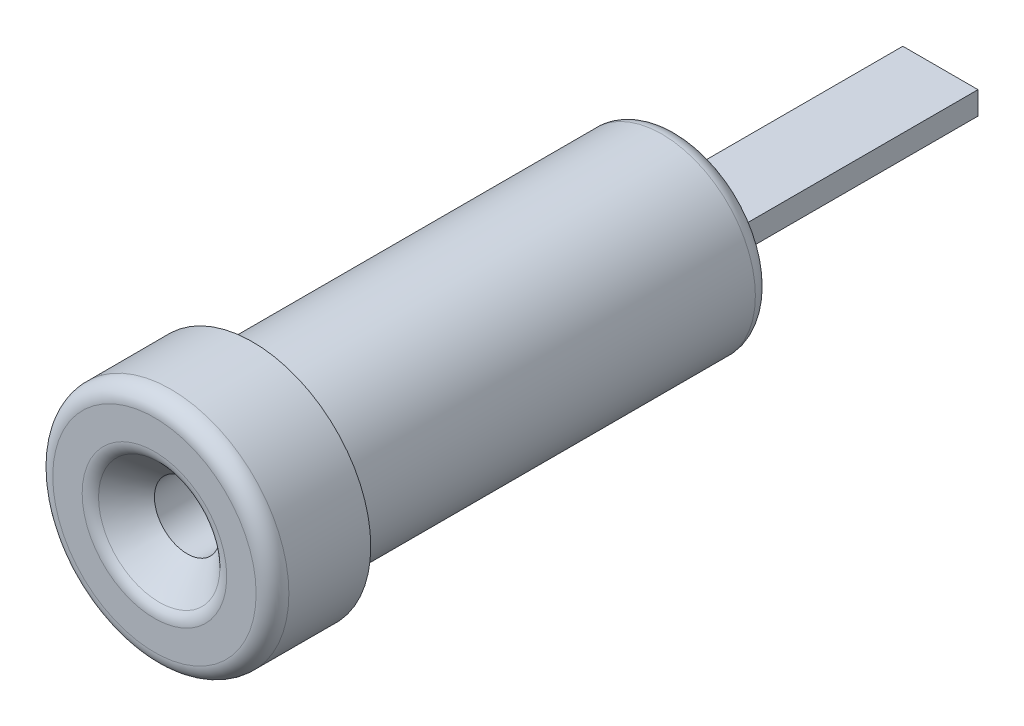
ISO-10303-21;
HEADER;
FILE_DESCRIPTION(('STEP AP214'),'2;1');
FILE_NAME('part.step','',(''),(''),'','','');
FILE_SCHEMA(('AUTOMOTIVE_DESIGN { 1 0 10303 214 1 1 1 1 }'));
ENDSEC;
DATA;
#1=APPLICATION_CONTEXT('core data for automotive mechanical design processes');
#2=APPLICATION_PROTOCOL_DEFINITION('international standard','automotive_design',2000,#1);
#3=PRODUCT_CONTEXT('',#1,'mechanical');
#4=PRODUCT('Part','Part','',(#3));
#5=PRODUCT_RELATED_PRODUCT_CATEGORY('part','',(#4));
#6=PRODUCT_DEFINITION_FORMATION('','',#4);
#7=PRODUCT_DEFINITION_CONTEXT('part definition',#1,'design');
#8=PRODUCT_DEFINITION('design','',#6,#7);
#9=PRODUCT_DEFINITION_SHAPE('','',#8);
#10=(LENGTH_UNIT() NAMED_UNIT(*) SI_UNIT(.MILLI.,.METRE.));
#11=(NAMED_UNIT(*) PLANE_ANGLE_UNIT() SI_UNIT($,.RADIAN.));
#12=(NAMED_UNIT(*) SI_UNIT($,.STERADIAN.) SOLID_ANGLE_UNIT());
#13=UNCERTAINTY_MEASURE_WITH_UNIT(LENGTH_MEASURE(1.E-05),#10,'distance_accuracy_value','');
#14=(GEOMETRIC_REPRESENTATION_CONTEXT(3) GLOBAL_UNCERTAINTY_ASSIGNED_CONTEXT((#13)) GLOBAL_UNIT_ASSIGNED_CONTEXT((#10,
#11,#12)) REPRESENTATION_CONTEXT('',''));
#15=CARTESIAN_POINT('',(0.,0.,0.));
#16=DIRECTION('',(0.,0.,1.));
#17=DIRECTION('',(1.,0.,0.));
#18=AXIS2_PLACEMENT_3D('',#15,#16,#17);
#19=CARTESIAN_POINT('',(0.,3.605,0.));
#20=DIRECTION('',(0.,0.,-1.));
#21=DIRECTION('',(-1.,0.,0.));
#22=AXIS2_PLACEMENT_3D('',#19,#20,#21);
#23=PLANE('',#22);
#24=CARTESIAN_POINT('',(0.,0.,0.));
#25=DIRECTION('',(0.,0.,-1.));
#26=DIRECTION('',(-1.,0.,0.));
#27=AXIS2_PLACEMENT_3D('',#24,#25,#26);
#28=CIRCLE('',#27,3.105);
#29=CARTESIAN_POINT('',(-3.105,0.,0.));
#30=VERTEX_POINT('',#29);
#31=EDGE_CURVE('E123',#30,#30,#28,.F.);
#32=ORIENTED_EDGE('',*,*,#31,.T.);
#33=EDGE_LOOP('',(#32));
#34=FACE_BOUND('',#33,.T.);
#35=CARTESIAN_POINT('',(0.,0.,0.));
#36=DIRECTION('',(0.,0.,-1.));
#37=DIRECTION('',(-1.,0.,0.));
#38=AXIS2_PLACEMENT_3D('',#35,#36,#37);
#39=CIRCLE('',#38,2.20710678118655);
#40=CARTESIAN_POINT('',(-2.20710678118655,0.,0.));
#41=VERTEX_POINT('',#40);
#42=EDGE_CURVE('E120',#41,#41,#39,.T.);
#43=ORIENTED_EDGE('',*,*,#42,.T.);
#44=EDGE_LOOP('',(#43));
#45=FACE_BOUND('',#44,.T.);
#46=ADVANCED_FACE('F35',(#34,#45),#23,.F.);
#47=CARTESIAN_POINT('',(0.,0.,0.));
#48=DIRECTION('',(0.,0.,1.));
#49=DIRECTION('',(1.,0.,0.));
#50=AXIS2_PLACEMENT_3D('',#47,#48,#49);
#51=CYLINDRICAL_SURFACE('',#50,1.);
#52=CARTESIAN_POINT('',(0.,0.,-1.));
#53=DIRECTION('',(0.,0.,-1.));
#54=DIRECTION('',(-1.,0.,0.));
#55=AXIS2_PLACEMENT_3D('',#52,#53,#54);
#56=CIRCLE('',#55,1.);
#57=CARTESIAN_POINT('',(-1.,0.,-1.));
#58=VERTEX_POINT('',#57);
#59=EDGE_CURVE('E117',#58,#58,#56,.F.);
#60=ORIENTED_EDGE('',*,*,#59,.T.);
#61=EDGE_LOOP('',(#60));
#62=FACE_BOUND('',#61,.T.);
#63=CARTESIAN_POINT('',(0.,0.,-12.));
#64=DIRECTION('',(0.,0.,1.));
#65=DIRECTION('',(1.,0.,0.));
#66=AXIS2_PLACEMENT_3D('',#63,#64,#65);
#67=CIRCLE('',#66,1.);
#68=CARTESIAN_POINT('',(1.,0.,-12.));
#69=VERTEX_POINT('',#68);
#70=EDGE_CURVE('E114',#69,#69,#67,.T.);
#71=ORIENTED_EDGE('',*,*,#70,.F.);
#72=EDGE_LOOP('',(#71));
#73=FACE_BOUND('',#72,.T.);
#74=ADVANCED_FACE('F147',(#62,#73),#51,.F.);
#75=CARTESIAN_POINT('',(0.,1.,-12.));
#76=DIRECTION('',(0.,0.,-1.));
#77=DIRECTION('',(-1.,0.,0.));
#78=AXIS2_PLACEMENT_3D('',#75,#76,#77);
#79=PLANE('',#78);
#80=ORIENTED_EDGE('',*,*,#70,.T.);
#81=EDGE_LOOP('',(#80));
#82=FACE_BOUND('',#81,.T.);
#83=ADVANCED_FACE('F153',(#82),#79,.F.);
#84=CARTESIAN_POINT('',(0.,1.2,-16.));
#85=DIRECTION('',(0.,0.,1.));
#86=DIRECTION('',(1.,0.,0.));
#87=AXIS2_PLACEMENT_3D('',#84,#85,#86);
#88=PLANE('',#87);
#89=CARTESIAN_POINT('',(0.,0.,-16.));
#90=DIRECTION('',(0.,0.,1.));
#91=DIRECTION('',(1.,0.,0.));
#92=AXIS2_PLACEMENT_3D('',#89,#90,#91);
#93=CIRCLE('',#92,2.35);
#94=CARTESIAN_POINT('',(2.35,0.,-16.));
#95=VERTEX_POINT('',#94);
#96=EDGE_CURVE('E11',#95,#95,#93,.F.);
#97=ORIENTED_EDGE('',*,*,#96,.T.);
#98=EDGE_LOOP('',(#97));
#99=FACE_BOUND('',#98,.T.);
#100=DIRECTION('',(0.,-1.,0.));
#101=VECTOR('',#100,1.);
#102=CARTESIAN_POINT('',(1.1478240283249,0.35,-16.));
#103=LINE('',#102,#101);
#104=CARTESIAN_POINT('',(1.1478240283249,0.35,-16.));
#105=VERTEX_POINT('',#104);
#106=CARTESIAN_POINT('',(1.1478240283249,-0.35,-16.));
#107=VERTEX_POINT('',#106);
#108=EDGE_CURVE('E89',#105,#107,#103,.T.);
#109=ORIENTED_EDGE('',*,*,#108,.F.);
#110=DIRECTION('',(1.,0.,0.));
#111=VECTOR('',#110,1.);
#112=CARTESIAN_POINT('',(1.1478240283249,0.35,-16.));
#113=LINE('',#112,#111);
#114=CARTESIAN_POINT('',(-1.1478240283249,0.35,-16.));
#115=VERTEX_POINT('',#114);
#116=EDGE_CURVE('E57',#115,#105,#113,.T.);
#117=ORIENTED_EDGE('',*,*,#116,.F.);
#118=DIRECTION('',(0.,1.,0.));
#119=VECTOR('',#118,1.);
#120=CARTESIAN_POINT('',(-1.1478240283249,0.35,-16.));
#121=LINE('',#120,#119);
#122=CARTESIAN_POINT('',(-1.1478240283249,-0.35,-16.));
#123=VERTEX_POINT('',#122);
#124=EDGE_CURVE('E86',#123,#115,#121,.T.);
#125=ORIENTED_EDGE('',*,*,#124,.F.);
#126=DIRECTION('',(-1.,0.,0.));
#127=VECTOR('',#126,1.);
#128=CARTESIAN_POINT('',(1.1478240283249,-0.35,-16.));
#129=LINE('',#128,#127);
#130=EDGE_CURVE('E94',#107,#123,#129,.T.);
#131=ORIENTED_EDGE('',*,*,#130,.F.);
#132=EDGE_LOOP('',(#109,#117,#125,#131));
#133=FACE_BOUND('',#132,.T.);
#134=ADVANCED_FACE('F85',(#99,#133),#88,.F.);
#135=CARTESIAN_POINT('',(0.,0.,0.));
#136=DIRECTION('',(0.,0.,1.));
#137=DIRECTION('',(1.,0.,0.));
#138=AXIS2_PLACEMENT_3D('',#135,#136,#137);
#139=CYLINDRICAL_SURFACE('',#138,2.85);
#140=CARTESIAN_POINT('',(0.,0.,-15.5));
#141=DIRECTION('',(0.,0.,1.));
#142=DIRECTION('',(1.,0.,0.));
#143=AXIS2_PLACEMENT_3D('',#140,#141,#142);
#144=CIRCLE('',#143,2.85);
#145=CARTESIAN_POINT('',(2.85,0.,-15.5));
#146=VERTEX_POINT('',#145);
#147=EDGE_CURVE('E43',#146,#146,#144,.T.);
#148=ORIENTED_EDGE('',*,*,#147,.T.);
#149=EDGE_LOOP('',(#148));
#150=FACE_BOUND('',#149,.T.);
#151=CARTESIAN_POINT('',(0.,0.,-3.));
#152=DIRECTION('',(0.,0.,1.));
#153=DIRECTION('',(1.,0.,0.));
#154=AXIS2_PLACEMENT_3D('',#151,#152,#153);
#155=CIRCLE('',#154,2.85);
#156=CARTESIAN_POINT('',(2.85,0.,-3.));
#157=VERTEX_POINT('',#156);
#158=EDGE_CURVE('E111',#157,#157,#155,.T.);
#159=ORIENTED_EDGE('',*,*,#158,.F.);
#160=EDGE_LOOP('',(#159));
#161=FACE_BOUND('',#160,.T.);
#162=ADVANCED_FACE('F134',(#150,#161),#139,.T.);
#163=CARTESIAN_POINT('',(0.,2.85,-3.));
#164=DIRECTION('',(0.,0.,1.));
#165=DIRECTION('',(1.,0.,0.));
#166=AXIS2_PLACEMENT_3D('',#163,#164,#165);
#167=PLANE('',#166);
#168=CARTESIAN_POINT('',(0.,0.,-3.));
#169=DIRECTION('',(0.,0.,1.));
#170=DIRECTION('',(1.,0.,0.));
#171=AXIS2_PLACEMENT_3D('',#168,#169,#170);
#172=CIRCLE('',#171,3.605);
#173=CARTESIAN_POINT('',(3.605,0.,-3.));
#174=VERTEX_POINT('',#173);
#175=EDGE_CURVE('E101',#174,#174,#172,.T.);
#176=ORIENTED_EDGE('',*,*,#175,.F.);
#177=EDGE_LOOP('',(#176));
#178=FACE_BOUND('',#177,.T.);
#179=ORIENTED_EDGE('',*,*,#158,.T.);
#180=EDGE_LOOP('',(#179));
#181=FACE_BOUND('',#180,.T.);
#182=ADVANCED_FACE('F175',(#178,#181),#167,.F.);
#183=CARTESIAN_POINT('',(0.,0.,0.));
#184=DIRECTION('',(0.,0.,1.));
#185=DIRECTION('',(1.,0.,0.));
#186=AXIS2_PLACEMENT_3D('',#183,#184,#185);
#187=CYLINDRICAL_SURFACE('',#186,3.605);
#188=CARTESIAN_POINT('',(0.,0.,-0.5));
#189=DIRECTION('',(0.,0.,-1.));
#190=DIRECTION('',(-1.,0.,0.));
#191=AXIS2_PLACEMENT_3D('',#188,#189,#190);
#192=CIRCLE('',#191,3.605);
#193=CARTESIAN_POINT('',(-3.605,0.,-0.5));
#194=VERTEX_POINT('',#193);
#195=EDGE_CURVE('E126',#194,#194,#192,.T.);
#196=ORIENTED_EDGE('',*,*,#195,.T.);
#197=EDGE_LOOP('',(#196));
#198=FACE_BOUND('',#197,.T.);
#199=ORIENTED_EDGE('',*,*,#175,.T.);
#200=EDGE_LOOP('',(#199));
#201=FACE_BOUND('',#200,.T.);
#202=ADVANCED_FACE('F172',(#198,#201),#187,.T.);
#203=CARTESIAN_POINT('',(-1.1478240283249,0.35,-10.3));
#204=DIRECTION('',(-1.,0.,0.));
#205=DIRECTION('',(0.,0.,1.));
#206=AXIS2_PLACEMENT_3D('',#203,#204,#205);
#207=PLANE('',#206);
#208=ORIENTED_EDGE('',*,*,#124,.T.);
#209=DIRECTION('',(0.,0.,-1.));
#210=VECTOR('',#209,1.);
#211=CARTESIAN_POINT('',(-1.1478240283249,0.35,-10.3));
#212=LINE('',#211,#210);
#213=CARTESIAN_POINT('',(-1.1478240283249,0.35,-24.));
#214=VERTEX_POINT('',#213);
#215=EDGE_CURVE('E75',#115,#214,#212,.T.);
#216=ORIENTED_EDGE('',*,*,#215,.T.);
#217=DIRECTION('',(0.,1.,0.));
#218=VECTOR('',#217,1.);
#219=CARTESIAN_POINT('',(-1.1478240283249,0.35,-24.));
#220=LINE('',#219,#218);
#221=CARTESIAN_POINT('',(-1.1478240283249,-0.35,-24.));
#222=VERTEX_POINT('',#221);
#223=EDGE_CURVE('E98',#222,#214,#220,.T.);
#224=ORIENTED_EDGE('',*,*,#223,.F.);
#225=DIRECTION('',(0.,0.,-1.));
#226=VECTOR('',#225,1.);
#227=CARTESIAN_POINT('',(-1.1478240283249,-0.35,-10.3));
#228=LINE('',#227,#226);
#229=EDGE_CURVE('E92',#123,#222,#228,.T.);
#230=ORIENTED_EDGE('',*,*,#229,.F.);
#231=EDGE_LOOP('',(#208,#216,#224,#230));
#232=FACE_BOUND('',#231,.T.);
#233=ADVANCED_FACE('F91',(#232),#207,.T.);
#234=CARTESIAN_POINT('',(1.1478240283249,-0.35,-10.3));
#235=DIRECTION('',(0.,-1.,0.));
#236=DIRECTION('',(0.,0.,-1.));
#237=AXIS2_PLACEMENT_3D('',#234,#235,#236);
#238=PLANE('',#237);
#239=ORIENTED_EDGE('',*,*,#130,.T.);
#240=ORIENTED_EDGE('',*,*,#229,.T.);
#241=DIRECTION('',(-1.,0.,0.));
#242=VECTOR('',#241,1.);
#243=CARTESIAN_POINT('',(1.1478240283249,-0.35,-24.));
#244=LINE('',#243,#242);
#245=CARTESIAN_POINT('',(1.1478240283249,-0.35,-24.));
#246=VERTEX_POINT('',#245);
#247=EDGE_CURVE('E106',#246,#222,#244,.T.);
#248=ORIENTED_EDGE('',*,*,#247,.F.);
#249=DIRECTION('',(0.,0.,-1.));
#250=VECTOR('',#249,1.);
#251=CARTESIAN_POINT('',(1.1478240283249,-0.35,-10.3));
#252=LINE('',#251,#250);
#253=EDGE_CURVE('E104',#107,#246,#252,.T.);
#254=ORIENTED_EDGE('',*,*,#253,.F.);
#255=EDGE_LOOP('',(#239,#240,#248,#254));
#256=FACE_BOUND('',#255,.T.);
#257=ADVANCED_FACE('F261',(#256),#238,.T.);
#258=CARTESIAN_POINT('',(1.1478240283249,0.35,-10.3));
#259=DIRECTION('',(1.,0.,0.));
#260=DIRECTION('',(0.,0.,-1.));
#261=AXIS2_PLACEMENT_3D('',#258,#259,#260);
#262=PLANE('',#261);
#263=ORIENTED_EDGE('',*,*,#108,.T.);
#264=ORIENTED_EDGE('',*,*,#253,.T.);
#265=DIRECTION('',(0.,-1.,0.));
#266=VECTOR('',#265,1.);
#267=CARTESIAN_POINT('',(1.1478240283249,0.35,-24.));
#268=LINE('',#267,#266);
#269=CARTESIAN_POINT('',(1.1478240283249,0.349999999999998,-24.));
#270=VERTEX_POINT('',#269);
#271=EDGE_CURVE('E50',#270,#246,#268,.T.);
#272=ORIENTED_EDGE('',*,*,#271,.F.);
#273=DIRECTION('',(0.,0.,-1.));
#274=VECTOR('',#273,1.);
#275=CARTESIAN_POINT('',(1.1478240283249,0.35,-10.3));
#276=LINE('',#275,#274);
#277=EDGE_CURVE('E107',#105,#270,#276,.T.);
#278=ORIENTED_EDGE('',*,*,#277,.F.);
#279=EDGE_LOOP('',(#263,#264,#272,#278));
#280=FACE_BOUND('',#279,.T.);
#281=ADVANCED_FACE('F255',(#280),#262,.T.);
#282=CARTESIAN_POINT('',(1.1478240283249,0.35,-10.3));
#283=DIRECTION('',(0.,1.,0.));
#284=DIRECTION('',(0.,0.,1.));
#285=AXIS2_PLACEMENT_3D('',#282,#283,#284);
#286=PLANE('',#285);
#287=ORIENTED_EDGE('',*,*,#116,.T.);
#288=ORIENTED_EDGE('',*,*,#277,.T.);
#289=DIRECTION('',(1.,0.,0.));
#290=VECTOR('',#289,1.);
#291=CARTESIAN_POINT('',(1.1478240283249,0.35,-24.));
#292=LINE('',#291,#290);
#293=EDGE_CURVE('E78',#214,#270,#292,.T.);
#294=ORIENTED_EDGE('',*,*,#293,.F.);
#295=ORIENTED_EDGE('',*,*,#215,.F.);
#296=EDGE_LOOP('',(#287,#288,#294,#295));
#297=FACE_BOUND('',#296,.T.);
#298=ADVANCED_FACE('F76',(#297),#286,.T.);
#299=CARTESIAN_POINT('',(0.,0.,-24.));
#300=DIRECTION('',(0.,0.,1.));
#301=DIRECTION('',(1.,0.,0.));
#302=AXIS2_PLACEMENT_3D('',#299,#300,#301);
#303=PLANE('',#302);
#304=ORIENTED_EDGE('',*,*,#223,.T.);
#305=ORIENTED_EDGE('',*,*,#293,.T.);
#306=ORIENTED_EDGE('',*,*,#271,.T.);
#307=ORIENTED_EDGE('',*,*,#247,.T.);
#308=EDGE_LOOP('',(#304,#305,#306,#307));
#309=FACE_BOUND('',#308,.T.);
#310=ADVANCED_FACE('F162',(#309),#303,.F.);
#311=CARTESIAN_POINT('',(0.,0.,-1.));
#312=DIRECTION('',(0.,0.,1.));
#313=DIRECTION('',(1.,0.,0.));
#314=AXIS2_PLACEMENT_3D('',#311,#312,#313);
#315=CONICAL_SURFACE('',#314,1.,0.78539816339745);
#316=CARTESIAN_POINT('',(0.,0.,-0.146446609406726));
#317=DIRECTION('',(0.,0.,1.));
#318=DIRECTION('',(1.,0.,0.));
#319=AXIS2_PLACEMENT_3D('',#316,#317,#318);
#320=CIRCLE('',#319,1.85355339059328);
#321=CARTESIAN_POINT('',(1.85355339059328,0.,-0.146446609406726));
#322=VERTEX_POINT('',#321);
#323=EDGE_CURVE('E129',#322,#322,#320,.T.);
#324=ORIENTED_EDGE('',*,*,#323,.T.);
#325=EDGE_LOOP('',(#324));
#326=FACE_BOUND('',#325,.T.);
#327=ORIENTED_EDGE('',*,*,#59,.F.);
#328=EDGE_LOOP('',(#327));
#329=FACE_BOUND('',#328,.T.);
#330=ADVANCED_FACE('F159',(#326,#329),#315,.F.);
#331=CARTESIAN_POINT('',(0.,0.,-0.5));
#332=DIRECTION('',(0.,0.,-1.));
#333=DIRECTION('',(-1.,0.,0.));
#334=AXIS2_PLACEMENT_3D('',#331,#332,#333);
#335=TOROIDAL_SURFACE('',#334,3.105,0.5);
#336=ORIENTED_EDGE('',*,*,#195,.F.);
#337=EDGE_LOOP('',(#336));
#338=FACE_BOUND('',#337,.T.);
#339=ORIENTED_EDGE('',*,*,#31,.F.);
#340=EDGE_LOOP('',(#339));
#341=FACE_BOUND('',#340,.T.);
#342=ADVANCED_FACE('F143',(#338,#341),#335,.T.);
#343=CARTESIAN_POINT('',(0.,0.,-0.5));
#344=DIRECTION('',(0.,0.,-1.));
#345=DIRECTION('',(-1.,0.,0.));
#346=AXIS2_PLACEMENT_3D('',#343,#344,#345);
#347=TOROIDAL_SURFACE('',#346,2.20710678118655,0.5);
#348=ORIENTED_EDGE('',*,*,#323,.F.);
#349=EDGE_LOOP('',(#348));
#350=FACE_BOUND('',#349,.T.);
#351=ORIENTED_EDGE('',*,*,#42,.F.);
#352=EDGE_LOOP('',(#351));
#353=FACE_BOUND('',#352,.T.);
#354=ADVANCED_FACE('F138',(#350,#353),#347,.T.);
#355=CARTESIAN_POINT('',(0.,0.,-15.5));
#356=DIRECTION('',(0.,0.,1.));
#357=DIRECTION('',(1.,0.,0.));
#358=AXIS2_PLACEMENT_3D('',#355,#356,#357);
#359=TOROIDAL_SURFACE('',#358,2.35,0.5);
#360=ORIENTED_EDGE('',*,*,#96,.F.);
#361=EDGE_LOOP('',(#360));
#362=FACE_BOUND('',#361,.T.);
#363=ORIENTED_EDGE('',*,*,#147,.F.);
#364=EDGE_LOOP('',(#363));
#365=FACE_BOUND('',#364,.T.);
#366=ADVANCED_FACE('F37',(#362,#365),#359,.T.);
#367=CLOSED_SHELL('',(#46,#74,#83,#134,#162,#182,#202,#233,#257,#281,#298,#310,#330,#342,#354,#366));
#368=MANIFOLD_SOLID_BREP('B2',#367);
#369=ADVANCED_BREP_SHAPE_REPRESENTATION('',(#18,#368),#14);
#370=SHAPE_DEFINITION_REPRESENTATION(#9,#369);
ENDSEC;
END-ISO-10303-21;
